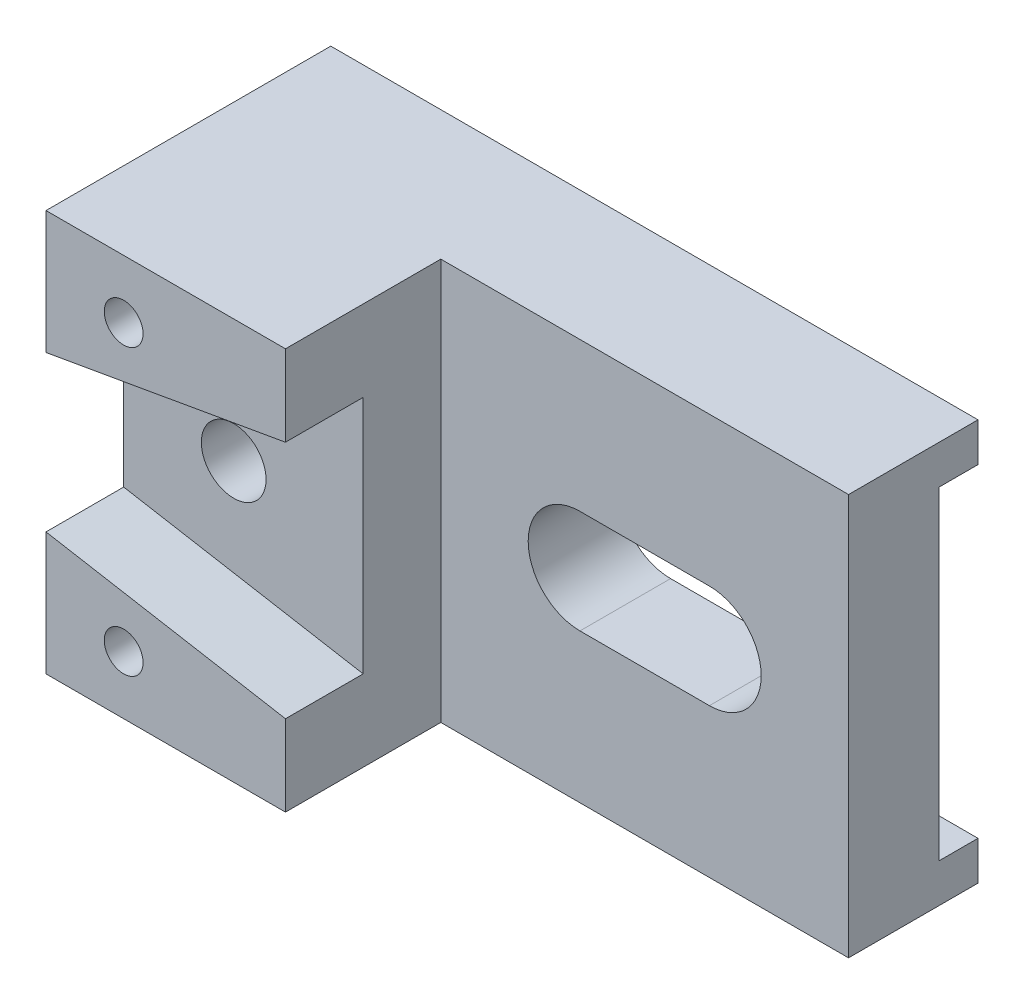
ISO-10303-21;
HEADER;
FILE_DESCRIPTION(('STEP AP214'),'2;1');
FILE_NAME('part.step','',(''),(''),'','','');
FILE_SCHEMA(('AUTOMOTIVE_DESIGN { 1 0 10303 214 1 1 1 1 }'));
ENDSEC;
DATA;
#1=APPLICATION_CONTEXT('core data for automotive mechanical design processes');
#2=APPLICATION_PROTOCOL_DEFINITION('international standard','automotive_design',2000,#1);
#3=PRODUCT_CONTEXT('',#1,'mechanical');
#4=PRODUCT('Part','Part','',(#3));
#5=PRODUCT_RELATED_PRODUCT_CATEGORY('part','',(#4));
#6=PRODUCT_DEFINITION_FORMATION('','',#4);
#7=PRODUCT_DEFINITION_CONTEXT('part definition',#1,'design');
#8=PRODUCT_DEFINITION('design','',#6,#7);
#9=PRODUCT_DEFINITION_SHAPE('','',#8);
#10=(LENGTH_UNIT() NAMED_UNIT(*) SI_UNIT(.MILLI.,.METRE.));
#11=(NAMED_UNIT(*) PLANE_ANGLE_UNIT() SI_UNIT($,.RADIAN.));
#12=(NAMED_UNIT(*) SI_UNIT($,.STERADIAN.) SOLID_ANGLE_UNIT());
#13=UNCERTAINTY_MEASURE_WITH_UNIT(LENGTH_MEASURE(1.E-05),#10,'distance_accuracy_value','');
#14=(GEOMETRIC_REPRESENTATION_CONTEXT(3) GLOBAL_UNCERTAINTY_ASSIGNED_CONTEXT((#13)) GLOBAL_UNIT_ASSIGNED_CONTEXT((#10,
#11,#12)) REPRESENTATION_CONTEXT('',''));
#15=CARTESIAN_POINT('',(0.,0.,0.));
#16=DIRECTION('',(0.,0.,1.));
#17=DIRECTION('',(1.,0.,0.));
#18=AXIS2_PLACEMENT_3D('',#15,#16,#17);
#19=CARTESIAN_POINT('',(0.,0.,0.));
#20=DIRECTION('',(0.,0.,1.));
#21=DIRECTION('',(1.,0.,0.));
#22=AXIS2_PLACEMENT_3D('',#19,#20,#21);
#23=PLANE('',#22);
#24=DIRECTION('',(0.,-1.,0.));
#25=VECTOR('',#24,1.);
#26=CARTESIAN_POINT('',(-50.,31.,0.));
#27=LINE('',#26,#25);
#28=CARTESIAN_POINT('',(-50.,-25.,0.));
#29=VERTEX_POINT('',#28);
#30=CARTESIAN_POINT('',(-50.,-31.,0.));
#31=VERTEX_POINT('',#30);
#32=EDGE_CURVE('E301',#29,#31,#27,.T.);
#33=ORIENTED_EDGE('',*,*,#32,.F.);
#34=DIRECTION('',(1.,0.,0.));
#35=VECTOR('',#34,1.);
#36=CARTESIAN_POINT('',(-50.,-25.,0.));
#37=LINE('',#36,#35);
#38=CARTESIAN_POINT('',(50.,-25.,0.));
#39=VERTEX_POINT('',#38);
#40=EDGE_CURVE('E188',#29,#39,#37,.T.);
#41=ORIENTED_EDGE('',*,*,#40,.T.);
#42=DIRECTION('',(0.,1.,0.));
#43=VECTOR('',#42,1.);
#44=CARTESIAN_POINT('',(50.,31.,0.));
#45=LINE('',#44,#43);
#46=CARTESIAN_POINT('',(50.,-31.,0.));
#47=VERTEX_POINT('',#46);
#48=EDGE_CURVE('E296',#47,#39,#45,.T.);
#49=ORIENTED_EDGE('',*,*,#48,.F.);
#50=DIRECTION('',(1.,0.,0.));
#51=VECTOR('',#50,1.);
#52=CARTESIAN_POINT('',(-50.,-31.,0.));
#53=LINE('',#52,#51);
#54=EDGE_CURVE('E291',#31,#47,#53,.T.);
#55=ORIENTED_EDGE('',*,*,#54,.F.);
#56=EDGE_LOOP('',(#33,#41,#49,#55));
#57=FACE_BOUND('',#56,.T.);
#58=ADVANCED_FACE('F33',(#57),#23,.F.);
#59=CARTESIAN_POINT('',(-50.,31.,20.));
#60=DIRECTION('',(1.,0.,0.));
#61=DIRECTION('',(0.,1.,0.));
#62=AXIS2_PLACEMENT_3D('',#59,#60,#61);
#63=PLANE('',#62);
#64=DIRECTION('',(0.,-1.,0.));
#65=VECTOR('',#64,1.);
#66=CARTESIAN_POINT('',(-50.,-25.,6.));
#67=LINE('',#66,#65);
#68=CARTESIAN_POINT('',(-50.,25.,6.));
#69=VERTEX_POINT('',#68);
#70=CARTESIAN_POINT('',(-50.,-25.,6.));
#71=VERTEX_POINT('',#70);
#72=EDGE_CURVE('E167',#69,#71,#67,.T.);
#73=ORIENTED_EDGE('',*,*,#72,.T.);
#74=DIRECTION('',(0.,0.,-1.));
#75=VECTOR('',#74,1.);
#76=CARTESIAN_POINT('',(-50.,-25.,0.));
#77=LINE('',#76,#75);
#78=EDGE_CURVE('E173',#71,#29,#77,.T.);
#79=ORIENTED_EDGE('',*,*,#78,.T.);
#80=ORIENTED_EDGE('',*,*,#32,.T.);
#81=DIRECTION('',(0.,0.,-1.));
#82=VECTOR('',#81,1.);
#83=CARTESIAN_POINT('',(-50.,-31.,20.));
#84=LINE('',#83,#82);
#85=CARTESIAN_POINT('',(-50.,-31.,44.));
#86=VERTEX_POINT('',#85);
#87=EDGE_CURVE('E306',#86,#31,#84,.T.);
#88=ORIENTED_EDGE('',*,*,#87,.F.);
#89=DIRECTION('',(0.,-1.,0.));
#90=VECTOR('',#89,1.);
#91=CARTESIAN_POINT('',(-50.,31.,44.));
#92=LINE('',#91,#90);
#93=CARTESIAN_POINT('',(-50.,-12.,44.));
#94=VERTEX_POINT('',#93);
#95=EDGE_CURVE('E268',#94,#86,#92,.T.);
#96=ORIENTED_EDGE('',*,*,#95,.F.);
#97=DIRECTION('',(0.,0.,1.));
#98=VECTOR('',#97,1.);
#99=CARTESIAN_POINT('',(-50.,-12.,32.));
#100=LINE('',#99,#98);
#101=CARTESIAN_POINT('',(-50.,-12.,32.));
#102=VERTEX_POINT('',#101);
#103=EDGE_CURVE('E262',#102,#94,#100,.T.);
#104=ORIENTED_EDGE('',*,*,#103,.F.);
#105=DIRECTION('',(0.,1.,0.));
#106=VECTOR('',#105,1.);
#107=CARTESIAN_POINT('',(-50.,-12.,32.));
#108=LINE('',#107,#106);
#109=CARTESIAN_POINT('',(-50.,12.,32.));
#110=VERTEX_POINT('',#109);
#111=EDGE_CURVE('E241',#102,#110,#108,.T.);
#112=ORIENTED_EDGE('',*,*,#111,.T.);
#113=DIRECTION('',(0.,0.,1.));
#114=VECTOR('',#113,1.);
#115=CARTESIAN_POINT('',(-50.,12.,32.));
#116=LINE('',#115,#114);
#117=CARTESIAN_POINT('',(-50.,12.,44.));
#118=VERTEX_POINT('',#117);
#119=EDGE_CURVE('E259',#110,#118,#116,.T.);
#120=ORIENTED_EDGE('',*,*,#119,.T.);
#121=CARTESIAN_POINT('',(-50.,31.,44.));
#122=VERTEX_POINT('',#121);
#123=EDGE_CURVE('E269',#122,#118,#92,.T.);
#124=ORIENTED_EDGE('',*,*,#123,.F.);
#125=DIRECTION('',(0.,0.,-1.));
#126=VECTOR('',#125,1.);
#127=CARTESIAN_POINT('',(-50.,31.,20.));
#128=LINE('',#127,#126);
#129=CARTESIAN_POINT('',(-50.,31.,0.));
#130=VERTEX_POINT('',#129);
#131=EDGE_CURVE('E309',#122,#130,#128,.T.);
#132=ORIENTED_EDGE('',*,*,#131,.T.);
#133=CARTESIAN_POINT('',(-50.,25.,0.));
#134=VERTEX_POINT('',#133);
#135=EDGE_CURVE('E179',#130,#134,#27,.T.);
#136=ORIENTED_EDGE('',*,*,#135,.T.);
#137=DIRECTION('',(0.,0.,1.));
#138=VECTOR('',#137,1.);
#139=CARTESIAN_POINT('',(-50.,25.,6.));
#140=LINE('',#139,#138);
#141=EDGE_CURVE('E48',#134,#69,#140,.T.);
#142=ORIENTED_EDGE('',*,*,#141,.T.);
#143=EDGE_LOOP('',(#73,#79,#80,#88,#96,#104,#112,#120,#124,#132,#136,#142));
#144=FACE_BOUND('',#143,.T.);
#145=ADVANCED_FACE('F176',(#144),#63,.F.);
#146=CARTESIAN_POINT('',(-13.,31.,44.));
#147=DIRECTION('',(-1.,0.,0.));
#148=DIRECTION('',(0.,-1.,0.));
#149=AXIS2_PLACEMENT_3D('',#146,#147,#148);
#150=PLANE('',#149);
#151=DIRECTION('',(0.,0.,1.));
#152=VECTOR('',#151,1.);
#153=CARTESIAN_POINT('',(-13.,-18.5,32.));
#154=LINE('',#153,#152);
#155=CARTESIAN_POINT('',(-13.,-18.5,32.));
#156=VERTEX_POINT('',#155);
#157=CARTESIAN_POINT('',(-13.,-18.5,44.));
#158=VERTEX_POINT('',#157);
#159=EDGE_CURVE('E250',#156,#158,#154,.T.);
#160=ORIENTED_EDGE('',*,*,#159,.T.);
#161=DIRECTION('',(0.,1.,0.));
#162=VECTOR('',#161,1.);
#163=CARTESIAN_POINT('',(-13.,31.,44.));
#164=LINE('',#163,#162);
#165=CARTESIAN_POINT('',(-13.,-31.,44.));
#166=VERTEX_POINT('',#165);
#167=EDGE_CURVE('E275',#166,#158,#164,.T.);
#168=ORIENTED_EDGE('',*,*,#167,.F.);
#169=DIRECTION('',(0.,0.,-1.));
#170=VECTOR('',#169,1.);
#171=CARTESIAN_POINT('',(-13.,-31.,44.));
#172=LINE('',#171,#170);
#173=CARTESIAN_POINT('',(-13.,-31.,20.));
#174=VERTEX_POINT('',#173);
#175=EDGE_CURVE('E283',#166,#174,#172,.T.);
#176=ORIENTED_EDGE('',*,*,#175,.T.);
#177=DIRECTION('',(0.,1.,0.));
#178=VECTOR('',#177,1.);
#179=CARTESIAN_POINT('',(-13.,31.,20.));
#180=LINE('',#179,#178);
#181=CARTESIAN_POINT('',(-13.,31.,20.));
#182=VERTEX_POINT('',#181);
#183=EDGE_CURVE('E264',#174,#182,#180,.T.);
#184=ORIENTED_EDGE('',*,*,#183,.T.);
#185=DIRECTION('',(0.,0.,-1.));
#186=VECTOR('',#185,1.);
#187=CARTESIAN_POINT('',(-13.,31.,44.));
#188=LINE('',#187,#186);
#189=CARTESIAN_POINT('',(-13.,31.,44.));
#190=VERTEX_POINT('',#189);
#191=EDGE_CURVE('E278',#190,#182,#188,.T.);
#192=ORIENTED_EDGE('',*,*,#191,.F.);
#193=CARTESIAN_POINT('',(-13.,18.5,44.));
#194=VERTEX_POINT('',#193);
#195=EDGE_CURVE('E274',#194,#190,#164,.T.);
#196=ORIENTED_EDGE('',*,*,#195,.F.);
#197=DIRECTION('',(0.,0.,1.));
#198=VECTOR('',#197,1.);
#199=CARTESIAN_POINT('',(-13.,18.5,32.));
#200=LINE('',#199,#198);
#201=CARTESIAN_POINT('',(-13.,18.5,32.));
#202=VERTEX_POINT('',#201);
#203=EDGE_CURVE('E257',#202,#194,#200,.T.);
#204=ORIENTED_EDGE('',*,*,#203,.F.);
#205=DIRECTION('',(0.,-1.,0.));
#206=VECTOR('',#205,1.);
#207=CARTESIAN_POINT('',(-13.,18.5,32.));
#208=LINE('',#207,#206);
#209=EDGE_CURVE('E247',#202,#156,#208,.T.);
#210=ORIENTED_EDGE('',*,*,#209,.T.);
#211=EDGE_LOOP('',(#160,#168,#176,#184,#192,#196,#204,#210));
#212=FACE_BOUND('',#211,.T.);
#213=ADVANCED_FACE('F340',(#212),#150,.F.);
#214=CARTESIAN_POINT('',(0.,0.,44.));
#215=DIRECTION('',(0.,0.,1.));
#216=DIRECTION('',(1.,0.,0.));
#217=AXIS2_PLACEMENT_3D('',#214,#215,#216);
#218=PLANE('',#217);
#219=CARTESIAN_POINT('',(-38.,-22.,44.));
#220=DIRECTION('',(0.,0.,1.));
#221=DIRECTION('',(1.,0.,0.));
#222=AXIS2_PLACEMENT_3D('',#219,#220,#221);
#223=CIRCLE('',#222,3.);
#224=CARTESIAN_POINT('',(-35.,-22.,44.));
#225=VERTEX_POINT('',#224);
#226=EDGE_CURVE('E217',#225,#225,#223,.T.);
#227=ORIENTED_EDGE('',*,*,#226,.F.);
#228=EDGE_LOOP('',(#227));
#229=FACE_BOUND('',#228,.T.);
#230=ORIENTED_EDGE('',*,*,#167,.T.);
#231=DIRECTION('',(-0.984917256307086,0.17302600448638,0.));
#232=VECTOR('',#231,1.);
#233=CARTESIAN_POINT('',(-13.,-18.5,44.));
#234=LINE('',#233,#232);
#235=EDGE_CURVE('E237',#158,#94,#234,.T.);
#236=ORIENTED_EDGE('',*,*,#235,.T.);
#237=ORIENTED_EDGE('',*,*,#95,.T.);
#238=DIRECTION('',(1.,0.,0.));
#239=VECTOR('',#238,1.);
#240=CARTESIAN_POINT('',(-50.,-31.,44.));
#241=LINE('',#240,#239);
#242=EDGE_CURVE('E272',#86,#166,#241,.T.);
#243=ORIENTED_EDGE('',*,*,#242,.T.);
#244=EDGE_LOOP('',(#230,#236,#237,#243));
#245=FACE_BOUND('',#244,.T.);
#246=ADVANCED_FACE('F354',(#229,#245),#218,.T.);
#247=CARTESIAN_POINT('',(-38.,22.,44.));
#248=DIRECTION('',(0.,0.,1.));
#249=DIRECTION('',(1.,0.,0.));
#250=AXIS2_PLACEMENT_3D('',#247,#248,#249);
#251=CIRCLE('',#250,3.);
#252=CARTESIAN_POINT('',(-35.,22.,44.));
#253=VERTEX_POINT('',#252);
#254=EDGE_CURVE('E226',#253,#253,#251,.T.);
#255=ORIENTED_EDGE('',*,*,#254,.F.);
#256=EDGE_LOOP('',(#255));
#257=FACE_BOUND('',#256,.T.);
#258=ORIENTED_EDGE('',*,*,#123,.T.);
#259=DIRECTION('',(0.984917256307087,0.17302600448638,0.));
#260=VECTOR('',#259,1.);
#261=CARTESIAN_POINT('',(-50.,12.,44.));
#262=LINE('',#261,#260);
#263=EDGE_CURVE('E242',#118,#194,#262,.T.);
#264=ORIENTED_EDGE('',*,*,#263,.T.);
#265=ORIENTED_EDGE('',*,*,#195,.T.);
#266=DIRECTION('',(-1.,0.,0.));
#267=VECTOR('',#266,1.);
#268=CARTESIAN_POINT('',(-13.,31.,44.));
#269=LINE('',#268,#267);
#270=EDGE_CURVE('E265',#190,#122,#269,.T.);
#271=ORIENTED_EDGE('',*,*,#270,.T.);
#272=EDGE_LOOP('',(#258,#264,#265,#271));
#273=FACE_BOUND('',#272,.T.);
#274=ADVANCED_FACE('F367',(#257,#273),#218,.T.);
#275=CARTESIAN_POINT('',(50.,31.,20.));
#276=DIRECTION('',(-1.,0.,0.));
#277=DIRECTION('',(0.,-1.,0.));
#278=AXIS2_PLACEMENT_3D('',#275,#276,#277);
#279=PLANE('',#278);
#280=ORIENTED_EDGE('',*,*,#48,.T.);
#281=DIRECTION('',(0.,0.,-1.));
#282=VECTOR('',#281,1.);
#283=CARTESIAN_POINT('',(50.,-25.,0.));
#284=LINE('',#283,#282);
#285=CARTESIAN_POINT('',(50.,-25.,6.));
#286=VERTEX_POINT('',#285);
#287=EDGE_CURVE('E180',#286,#39,#284,.T.);
#288=ORIENTED_EDGE('',*,*,#287,.F.);
#289=DIRECTION('',(0.,-1.,0.));
#290=VECTOR('',#289,1.);
#291=CARTESIAN_POINT('',(50.,-25.,6.));
#292=LINE('',#291,#290);
#293=CARTESIAN_POINT('',(50.,25.,6.));
#294=VERTEX_POINT('',#293);
#295=EDGE_CURVE('E182',#294,#286,#292,.T.);
#296=ORIENTED_EDGE('',*,*,#295,.F.);
#297=DIRECTION('',(0.,0.,1.));
#298=VECTOR('',#297,1.);
#299=CARTESIAN_POINT('',(50.,25.,6.));
#300=LINE('',#299,#298);
#301=CARTESIAN_POINT('',(50.,25.,0.));
#302=VERTEX_POINT('',#301);
#303=EDGE_CURVE('E159',#302,#294,#300,.T.);
#304=ORIENTED_EDGE('',*,*,#303,.F.);
#305=CARTESIAN_POINT('',(50.,31.,0.));
#306=VERTEX_POINT('',#305);
#307=EDGE_CURVE('E286',#302,#306,#45,.T.);
#308=ORIENTED_EDGE('',*,*,#307,.T.);
#309=DIRECTION('',(0.,0.,-1.));
#310=VECTOR('',#309,1.);
#311=CARTESIAN_POINT('',(50.,31.,20.));
#312=LINE('',#311,#310);
#313=CARTESIAN_POINT('',(50.,31.,20.));
#314=VERTEX_POINT('',#313);
#315=EDGE_CURVE('E41',#314,#306,#312,.T.);
#316=ORIENTED_EDGE('',*,*,#315,.F.);
#317=DIRECTION('',(0.,1.,0.));
#318=VECTOR('',#317,1.);
#319=CARTESIAN_POINT('',(50.,31.,20.));
#320=LINE('',#319,#318);
#321=CARTESIAN_POINT('',(50.,-31.,20.));
#322=VERTEX_POINT('',#321);
#323=EDGE_CURVE('E287',#322,#314,#320,.T.);
#324=ORIENTED_EDGE('',*,*,#323,.F.);
#325=DIRECTION('',(0.,0.,-1.));
#326=VECTOR('',#325,1.);
#327=CARTESIAN_POINT('',(50.,-31.,20.));
#328=LINE('',#327,#326);
#329=EDGE_CURVE('E295',#322,#47,#328,.T.);
#330=ORIENTED_EDGE('',*,*,#329,.T.);
#331=EDGE_LOOP('',(#280,#288,#296,#304,#308,#316,#324,#330));
#332=FACE_BOUND('',#331,.T.);
#333=ADVANCED_FACE('F35',(#332),#279,.F.);
#334=CARTESIAN_POINT('',(-50.,31.,20.));
#335=DIRECTION('',(0.,-1.,0.));
#336=DIRECTION('',(0.,0.,-1.));
#337=AXIS2_PLACEMENT_3D('',#334,#335,#336);
#338=PLANE('',#337);
#339=DIRECTION('',(-1.,0.,0.));
#340=VECTOR('',#339,1.);
#341=CARTESIAN_POINT('',(-50.,31.,0.));
#342=LINE('',#341,#340);
#343=EDGE_CURVE('E299',#306,#130,#342,.T.);
#344=ORIENTED_EDGE('',*,*,#343,.T.);
#345=ORIENTED_EDGE('',*,*,#131,.F.);
#346=ORIENTED_EDGE('',*,*,#270,.F.);
#347=ORIENTED_EDGE('',*,*,#191,.T.);
#348=DIRECTION('',(-1.,0.,0.));
#349=VECTOR('',#348,1.);
#350=CARTESIAN_POINT('',(-50.,31.,20.));
#351=LINE('',#350,#349);
#352=EDGE_CURVE('E290',#314,#182,#351,.T.);
#353=ORIENTED_EDGE('',*,*,#352,.F.);
#354=ORIENTED_EDGE('',*,*,#315,.T.);
#355=EDGE_LOOP('',(#344,#345,#346,#347,#353,#354));
#356=FACE_BOUND('',#355,.T.);
#357=ADVANCED_FACE('F313',(#356),#338,.F.);
#358=CARTESIAN_POINT('',(-50.,-31.,20.));
#359=DIRECTION('',(0.,1.,0.));
#360=DIRECTION('',(0.,0.,1.));
#361=AXIS2_PLACEMENT_3D('',#358,#359,#360);
#362=PLANE('',#361);
#363=ORIENTED_EDGE('',*,*,#54,.T.);
#364=ORIENTED_EDGE('',*,*,#329,.F.);
#365=DIRECTION('',(1.,0.,0.));
#366=VECTOR('',#365,1.);
#367=CARTESIAN_POINT('',(-50.,-31.,20.));
#368=LINE('',#367,#366);
#369=EDGE_CURVE('E293',#174,#322,#368,.T.);
#370=ORIENTED_EDGE('',*,*,#369,.F.);
#371=ORIENTED_EDGE('',*,*,#175,.F.);
#372=ORIENTED_EDGE('',*,*,#242,.F.);
#373=ORIENTED_EDGE('',*,*,#87,.T.);
#374=EDGE_LOOP('',(#363,#364,#370,#371,#372,#373));
#375=FACE_BOUND('',#374,.T.);
#376=ADVANCED_FACE('F331',(#375),#362,.F.);
#377=CARTESIAN_POINT('',(0.,0.,20.));
#378=DIRECTION('',(0.,0.,1.));
#379=DIRECTION('',(1.,0.,0.));
#380=AXIS2_PLACEMENT_3D('',#377,#378,#379);
#381=PLANE('',#380);
#382=CARTESIAN_POINT('',(8.5,0.,20.));
#383=DIRECTION('',(0.,0.,1.));
#384=DIRECTION('',(1.,0.,0.));
#385=AXIS2_PLACEMENT_3D('',#382,#383,#384);
#386=CIRCLE('',#385,8.);
#387=CARTESIAN_POINT('',(8.5,8.,20.));
#388=VERTEX_POINT('',#387);
#389=CARTESIAN_POINT('',(8.5,-8.,20.));
#390=VERTEX_POINT('',#389);
#391=EDGE_CURVE('E202',#388,#390,#386,.T.);
#392=ORIENTED_EDGE('',*,*,#391,.F.);
#393=DIRECTION('',(1.,0.,0.));
#394=VECTOR('',#393,1.);
#395=CARTESIAN_POINT('',(8.5,8.,20.));
#396=LINE('',#395,#394);
#397=CARTESIAN_POINT('',(28.5,8.,20.));
#398=VERTEX_POINT('',#397);
#399=EDGE_CURVE('E211',#388,#398,#396,.T.);
#400=ORIENTED_EDGE('',*,*,#399,.T.);
#401=CARTESIAN_POINT('',(28.5,0.,20.));
#402=DIRECTION('',(0.,0.,1.));
#403=DIRECTION('',(1.,0.,0.));
#404=AXIS2_PLACEMENT_3D('',#401,#402,#403);
#405=CIRCLE('',#404,8.);
#406=CARTESIAN_POINT('',(28.5,-8.,20.));
#407=VERTEX_POINT('',#406);
#408=EDGE_CURVE('E208',#407,#398,#405,.T.);
#409=ORIENTED_EDGE('',*,*,#408,.F.);
#410=DIRECTION('',(1.,0.,0.));
#411=VECTOR('',#410,1.);
#412=CARTESIAN_POINT('',(8.5,-8.,20.));
#413=LINE('',#412,#411);
#414=EDGE_CURVE('E205',#390,#407,#413,.T.);
#415=ORIENTED_EDGE('',*,*,#414,.F.);
#416=EDGE_LOOP('',(#392,#400,#409,#415));
#417=FACE_BOUND('',#416,.T.);
#418=ORIENTED_EDGE('',*,*,#183,.F.);
#419=ORIENTED_EDGE('',*,*,#369,.T.);
#420=ORIENTED_EDGE('',*,*,#323,.T.);
#421=ORIENTED_EDGE('',*,*,#352,.T.);
#422=EDGE_LOOP('',(#418,#419,#420,#421));
#423=FACE_BOUND('',#422,.T.);
#424=ADVANCED_FACE('F322',(#417,#423),#381,.T.);
#425=ORIENTED_EDGE('',*,*,#307,.F.);
#426=DIRECTION('',(1.,0.,0.));
#427=VECTOR('',#426,1.);
#428=CARTESIAN_POINT('',(-50.,25.,0.));
#429=LINE('',#428,#427);
#430=EDGE_CURVE('E164',#134,#302,#429,.T.);
#431=ORIENTED_EDGE('',*,*,#430,.F.);
#432=ORIENTED_EDGE('',*,*,#135,.F.);
#433=ORIENTED_EDGE('',*,*,#343,.F.);
#434=EDGE_LOOP('',(#425,#431,#432,#433));
#435=FACE_BOUND('',#434,.T.);
#436=ADVANCED_FACE('F319',(#435),#23,.F.);
#437=CARTESIAN_POINT('',(-13.,-18.5,32.));
#438=DIRECTION('',(0.17302600448638,0.984917256307087,0.));
#439=DIRECTION('',(-0.984917256307087,0.17302600448638,0.));
#440=AXIS2_PLACEMENT_3D('',#437,#438,#439);
#441=PLANE('',#440);
#442=ORIENTED_EDGE('',*,*,#235,.F.);
#443=ORIENTED_EDGE('',*,*,#159,.F.);
#444=DIRECTION('',(-0.984917256307086,0.17302600448638,0.));
#445=VECTOR('',#444,1.);
#446=CARTESIAN_POINT('',(-13.,-18.5,32.));
#447=LINE('',#446,#445);
#448=EDGE_CURVE('E238',#156,#102,#447,.T.);
#449=ORIENTED_EDGE('',*,*,#448,.T.);
#450=ORIENTED_EDGE('',*,*,#103,.T.);
#451=EDGE_LOOP('',(#442,#443,#449,#450));
#452=FACE_BOUND('',#451,.T.);
#453=ADVANCED_FACE('F321',(#452),#441,.T.);
#454=CARTESIAN_POINT('',(-50.,12.,32.));
#455=DIRECTION('',(0.17302600448638,-0.984917256307086,0.));
#456=DIRECTION('',(0.984917256307087,0.17302600448638,0.));
#457=AXIS2_PLACEMENT_3D('',#454,#455,#456);
#458=PLANE('',#457);
#459=ORIENTED_EDGE('',*,*,#263,.F.);
#460=ORIENTED_EDGE('',*,*,#119,.F.);
#461=DIRECTION('',(0.984917256307087,0.17302600448638,0.));
#462=VECTOR('',#461,1.);
#463=CARTESIAN_POINT('',(-50.,12.,32.));
#464=LINE('',#463,#462);
#465=EDGE_CURVE('E245',#110,#202,#464,.T.);
#466=ORIENTED_EDGE('',*,*,#465,.T.);
#467=ORIENTED_EDGE('',*,*,#203,.T.);
#468=EDGE_LOOP('',(#459,#460,#466,#467));
#469=FACE_BOUND('',#468,.T.);
#470=ADVANCED_FACE('F328',(#469),#458,.T.);
#471=CARTESIAN_POINT('',(0.,0.,32.));
#472=DIRECTION('',(0.,0.,-1.));
#473=DIRECTION('',(-1.,0.,0.));
#474=AXIS2_PLACEMENT_3D('',#471,#472,#473);
#475=PLANE('',#474);
#476=CARTESIAN_POINT('',(-33.,0.,32.));
#477=DIRECTION('',(0.,0.,1.));
#478=DIRECTION('',(1.,0.,0.));
#479=AXIS2_PLACEMENT_3D('',#476,#477,#478);
#480=CIRCLE('',#479,5.);
#481=CARTESIAN_POINT('',(-28.,0.,32.));
#482=VERTEX_POINT('',#481);
#483=EDGE_CURVE('E232',#482,#482,#480,.T.);
#484=ORIENTED_EDGE('',*,*,#483,.F.);
#485=EDGE_LOOP('',(#484));
#486=FACE_BOUND('',#485,.T.);
#487=ORIENTED_EDGE('',*,*,#448,.F.);
#488=ORIENTED_EDGE('',*,*,#209,.F.);
#489=ORIENTED_EDGE('',*,*,#465,.F.);
#490=ORIENTED_EDGE('',*,*,#111,.F.);
#491=EDGE_LOOP('',(#487,#488,#489,#490));
#492=FACE_BOUND('',#491,.T.);
#493=ADVANCED_FACE('F359',(#486,#492),#475,.F.);
#494=CARTESIAN_POINT('',(-33.,0.,0.));
#495=DIRECTION('',(0.,0.,1.));
#496=DIRECTION('',(1.,0.,0.));
#497=AXIS2_PLACEMENT_3D('',#494,#495,#496);
#498=CYLINDRICAL_SURFACE('',#497,5.);
#499=CARTESIAN_POINT('',(-33.,0.,6.));
#500=DIRECTION('',(0.,0.,1.));
#501=DIRECTION('',(1.,0.,0.));
#502=AXIS2_PLACEMENT_3D('',#499,#500,#501);
#503=CIRCLE('',#502,5.);
#504=CARTESIAN_POINT('',(-28.,0.,6.));
#505=VERTEX_POINT('',#504);
#506=EDGE_CURVE('E199',#505,#505,#503,.F.);
#507=ORIENTED_EDGE('',*,*,#506,.T.);
#508=EDGE_LOOP('',(#507));
#509=FACE_BOUND('',#508,.T.);
#510=ORIENTED_EDGE('',*,*,#483,.T.);
#511=EDGE_LOOP('',(#510));
#512=FACE_BOUND('',#511,.T.);
#513=ADVANCED_FACE('F414',(#509,#512),#498,.F.);
#514=CARTESIAN_POINT('',(-38.,22.,24.));
#515=DIRECTION('',(0.,0.,1.));
#516=DIRECTION('',(1.,0.,0.));
#517=AXIS2_PLACEMENT_3D('',#514,#515,#516);
#518=CYLINDRICAL_SURFACE('',#517,3.);
#519=CARTESIAN_POINT('',(-38.,22.,24.));
#520=DIRECTION('',(0.,0.,1.));
#521=DIRECTION('',(1.,0.,0.));
#522=AXIS2_PLACEMENT_3D('',#519,#520,#521);
#523=CIRCLE('',#522,3.);
#524=CARTESIAN_POINT('',(-35.,22.,24.));
#525=VERTEX_POINT('',#524);
#526=EDGE_CURVE('E229',#525,#525,#523,.T.);
#527=ORIENTED_EDGE('',*,*,#526,.F.);
#528=EDGE_LOOP('',(#527));
#529=FACE_BOUND('',#528,.T.);
#530=ORIENTED_EDGE('',*,*,#254,.T.);
#531=EDGE_LOOP('',(#530));
#532=FACE_BOUND('',#531,.T.);
#533=ADVANCED_FACE('F410',(#529,#532),#518,.F.);
#534=CARTESIAN_POINT('',(-38.,22.,24.));
#535=DIRECTION('',(0.,0.,1.));
#536=DIRECTION('',(1.,0.,0.));
#537=AXIS2_PLACEMENT_3D('',#534,#535,#536);
#538=PLANE('',#537);
#539=ORIENTED_EDGE('',*,*,#526,.T.);
#540=EDGE_LOOP('',(#539));
#541=FACE_BOUND('',#540,.T.);
#542=ADVANCED_FACE('F406',(#541),#538,.T.);
#543=CARTESIAN_POINT('',(-38.,-22.,24.));
#544=DIRECTION('',(0.,0.,1.));
#545=DIRECTION('',(1.,0.,0.));
#546=AXIS2_PLACEMENT_3D('',#543,#544,#545);
#547=CYLINDRICAL_SURFACE('',#546,3.);
#548=CARTESIAN_POINT('',(-38.,-22.,24.));
#549=DIRECTION('',(0.,0.,1.));
#550=DIRECTION('',(1.,0.,0.));
#551=AXIS2_PLACEMENT_3D('',#548,#549,#550);
#552=CIRCLE('',#551,3.);
#553=CARTESIAN_POINT('',(-35.,-22.,24.));
#554=VERTEX_POINT('',#553);
#555=EDGE_CURVE('E223',#554,#554,#552,.T.);
#556=ORIENTED_EDGE('',*,*,#555,.F.);
#557=EDGE_LOOP('',(#556));
#558=FACE_BOUND('',#557,.T.);
#559=ORIENTED_EDGE('',*,*,#226,.T.);
#560=EDGE_LOOP('',(#559));
#561=FACE_BOUND('',#560,.T.);
#562=ADVANCED_FACE('F402',(#558,#561),#547,.F.);
#563=CARTESIAN_POINT('',(-38.,-22.,24.));
#564=DIRECTION('',(0.,0.,1.));
#565=DIRECTION('',(1.,0.,0.));
#566=AXIS2_PLACEMENT_3D('',#563,#564,#565);
#567=PLANE('',#566);
#568=ORIENTED_EDGE('',*,*,#555,.T.);
#569=EDGE_LOOP('',(#568));
#570=FACE_BOUND('',#569,.T.);
#571=ADVANCED_FACE('F398',(#570),#567,.T.);
#572=CARTESIAN_POINT('',(8.5,0.,0.));
#573=DIRECTION('',(0.,0.,1.));
#574=DIRECTION('',(1.,0.,0.));
#575=AXIS2_PLACEMENT_3D('',#572,#573,#574);
#576=CYLINDRICAL_SURFACE('',#575,8.);
#577=DIRECTION('',(0.,0.,1.));
#578=VECTOR('',#577,1.);
#579=CARTESIAN_POINT('',(8.5,-8.,0.));
#580=LINE('',#579,#578);
#581=CARTESIAN_POINT('',(8.5,-8.,6.));
#582=VERTEX_POINT('',#581);
#583=EDGE_CURVE('E214',#582,#390,#580,.T.);
#584=ORIENTED_EDGE('',*,*,#583,.F.);
#585=CARTESIAN_POINT('',(8.5,0.,6.));
#586=DIRECTION('',(0.,0.,1.));
#587=DIRECTION('',(1.,0.,0.));
#588=AXIS2_PLACEMENT_3D('',#585,#586,#587);
#589=CIRCLE('',#588,8.);
#590=CARTESIAN_POINT('',(8.5,8.,6.));
#591=VERTEX_POINT('',#590);
#592=EDGE_CURVE('E56',#582,#591,#589,.F.);
#593=ORIENTED_EDGE('',*,*,#592,.T.);
#594=DIRECTION('',(0.,0.,1.));
#595=VECTOR('',#594,1.);
#596=CARTESIAN_POINT('',(8.5,8.,0.));
#597=LINE('',#596,#595);
#598=EDGE_CURVE('E215',#591,#388,#597,.T.);
#599=ORIENTED_EDGE('',*,*,#598,.T.);
#600=ORIENTED_EDGE('',*,*,#391,.T.);
#601=EDGE_LOOP('',(#584,#593,#599,#600));
#602=FACE_BOUND('',#601,.T.);
#603=ADVANCED_FACE('F388',(#602),#576,.F.);
#604=CARTESIAN_POINT('',(8.5,8.,0.));
#605=DIRECTION('',(0.,-1.,0.));
#606=DIRECTION('',(0.,0.,-1.));
#607=AXIS2_PLACEMENT_3D('',#604,#605,#606);
#608=PLANE('',#607);
#609=DIRECTION('',(-1.,0.,0.));
#610=VECTOR('',#609,1.);
#611=CARTESIAN_POINT('',(8.5,8.,6.));
#612=LINE('',#611,#610);
#613=CARTESIAN_POINT('',(28.5,8.,6.));
#614=VERTEX_POINT('',#613);
#615=EDGE_CURVE('E196',#614,#591,#612,.T.);
#616=ORIENTED_EDGE('',*,*,#615,.F.);
#617=DIRECTION('',(0.,0.,1.));
#618=VECTOR('',#617,1.);
#619=CARTESIAN_POINT('',(28.5,8.,0.));
#620=LINE('',#619,#618);
#621=EDGE_CURVE('E218',#614,#398,#620,.T.);
#622=ORIENTED_EDGE('',*,*,#621,.T.);
#623=ORIENTED_EDGE('',*,*,#399,.F.);
#624=ORIENTED_EDGE('',*,*,#598,.F.);
#625=EDGE_LOOP('',(#616,#622,#623,#624));
#626=FACE_BOUND('',#625,.T.);
#627=ADVANCED_FACE('F384',(#626),#608,.T.);
#628=CARTESIAN_POINT('',(28.5,0.,0.));
#629=DIRECTION('',(0.,0.,1.));
#630=DIRECTION('',(1.,0.,0.));
#631=AXIS2_PLACEMENT_3D('',#628,#629,#630);
#632=CYLINDRICAL_SURFACE('',#631,8.);
#633=ORIENTED_EDGE('',*,*,#621,.F.);
#634=CARTESIAN_POINT('',(28.5,0.,6.));
#635=DIRECTION('',(0.,0.,1.));
#636=DIRECTION('',(1.,0.,0.));
#637=AXIS2_PLACEMENT_3D('',#634,#635,#636);
#638=CIRCLE('',#637,8.);
#639=CARTESIAN_POINT('',(28.5,-8.,6.));
#640=VERTEX_POINT('',#639);
#641=EDGE_CURVE('E191',#614,#640,#638,.F.);
#642=ORIENTED_EDGE('',*,*,#641,.T.);
#643=DIRECTION('',(0.,0.,1.));
#644=VECTOR('',#643,1.);
#645=CARTESIAN_POINT('',(28.5,-8.,0.));
#646=LINE('',#645,#644);
#647=EDGE_CURVE('E220',#640,#407,#646,.T.);
#648=ORIENTED_EDGE('',*,*,#647,.T.);
#649=ORIENTED_EDGE('',*,*,#408,.T.);
#650=EDGE_LOOP('',(#633,#642,#648,#649));
#651=FACE_BOUND('',#650,.T.);
#652=ADVANCED_FACE('F387',(#651),#632,.F.);
#653=CARTESIAN_POINT('',(8.5,-8.,0.));
#654=DIRECTION('',(0.,-1.,0.));
#655=DIRECTION('',(0.,0.,-1.));
#656=AXIS2_PLACEMENT_3D('',#653,#654,#655);
#657=PLANE('',#656);
#658=ORIENTED_EDGE('',*,*,#647,.F.);
#659=DIRECTION('',(-1.,0.,0.));
#660=VECTOR('',#659,1.);
#661=CARTESIAN_POINT('',(8.5,-8.,6.));
#662=LINE('',#661,#660);
#663=EDGE_CURVE('E11',#640,#582,#662,.T.);
#664=ORIENTED_EDGE('',*,*,#663,.T.);
#665=ORIENTED_EDGE('',*,*,#583,.T.);
#666=ORIENTED_EDGE('',*,*,#414,.T.);
#667=EDGE_LOOP('',(#658,#664,#665,#666));
#668=FACE_BOUND('',#667,.T.);
#669=ADVANCED_FACE('F381',(#668),#657,.F.);
#670=CARTESIAN_POINT('',(-50.,-25.,6.));
#671=DIRECTION('',(0.,0.,1.));
#672=DIRECTION('',(1.,0.,0.));
#673=AXIS2_PLACEMENT_3D('',#670,#671,#672);
#674=PLANE('',#673);
#675=ORIENTED_EDGE('',*,*,#663,.F.);
#676=ORIENTED_EDGE('',*,*,#641,.F.);
#677=ORIENTED_EDGE('',*,*,#615,.T.);
#678=ORIENTED_EDGE('',*,*,#592,.F.);
#679=EDGE_LOOP('',(#675,#676,#677,#678));
#680=FACE_BOUND('',#679,.T.);
#681=ORIENTED_EDGE('',*,*,#295,.T.);
#682=DIRECTION('',(1.,0.,0.));
#683=VECTOR('',#682,1.);
#684=CARTESIAN_POINT('',(-50.,-25.,6.));
#685=LINE('',#684,#683);
#686=EDGE_CURVE('E163',#71,#286,#685,.T.);
#687=ORIENTED_EDGE('',*,*,#686,.F.);
#688=ORIENTED_EDGE('',*,*,#72,.F.);
#689=DIRECTION('',(1.,0.,0.));
#690=VECTOR('',#689,1.);
#691=CARTESIAN_POINT('',(-50.,25.,6.));
#692=LINE('',#691,#690);
#693=EDGE_CURVE('E155',#69,#294,#692,.T.);
#694=ORIENTED_EDGE('',*,*,#693,.T.);
#695=EDGE_LOOP('',(#681,#687,#688,#694));
#696=FACE_BOUND('',#695,.T.);
#697=ORIENTED_EDGE('',*,*,#506,.F.);
#698=EDGE_LOOP('',(#697));
#699=FACE_BOUND('',#698,.T.);
#700=ADVANCED_FACE('F168',(#680,#696,#699),#674,.F.);
#701=CARTESIAN_POINT('',(-50.,-25.,0.));
#702=DIRECTION('',(0.,-1.,0.));
#703=DIRECTION('',(1.,0.,0.));
#704=AXIS2_PLACEMENT_3D('',#701,#702,#703);
#705=PLANE('',#704);
#706=ORIENTED_EDGE('',*,*,#287,.T.);
#707=ORIENTED_EDGE('',*,*,#40,.F.);
#708=ORIENTED_EDGE('',*,*,#78,.F.);
#709=ORIENTED_EDGE('',*,*,#686,.T.);
#710=EDGE_LOOP('',(#706,#707,#708,#709));
#711=FACE_BOUND('',#710,.T.);
#712=ADVANCED_FACE('F373',(#711),#705,.F.);
#713=CARTESIAN_POINT('',(-50.,25.,6.));
#714=DIRECTION('',(0.,1.,0.));
#715=DIRECTION('',(-1.,0.,0.));
#716=AXIS2_PLACEMENT_3D('',#713,#714,#715);
#717=PLANE('',#716);
#718=ORIENTED_EDGE('',*,*,#303,.T.);
#719=ORIENTED_EDGE('',*,*,#693,.F.);
#720=ORIENTED_EDGE('',*,*,#141,.F.);
#721=ORIENTED_EDGE('',*,*,#430,.T.);
#722=EDGE_LOOP('',(#718,#719,#720,#721));
#723=FACE_BOUND('',#722,.T.);
#724=ADVANCED_FACE('F157',(#723),#717,.F.);
#725=CLOSED_SHELL('',(#58,#145,#213,#246,#274,#333,#357,#376,#424,#436,#453,#470,#493,#513,#533,
#542,#562,#571,#603,#627,#652,#669,#700,#712,#724));
#726=MANIFOLD_SOLID_BREP('B2',#725);
#727=ADVANCED_BREP_SHAPE_REPRESENTATION('',(#18,#726),#14);
#728=SHAPE_DEFINITION_REPRESENTATION(#9,#727);
ENDSEC;
END-ISO-10303-21;
